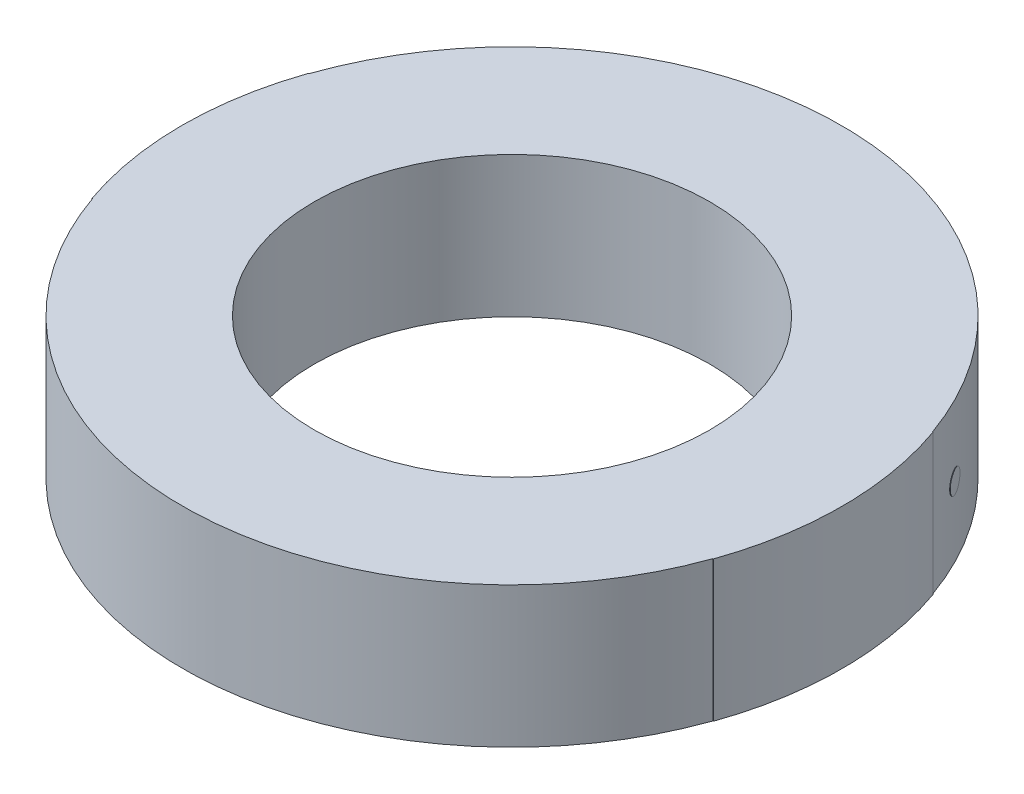
ISO-10303-21;
HEADER;
FILE_DESCRIPTION(('STEP AP214'),'2;1');
FILE_NAME('part.step','',(''),(''),'','','');
FILE_SCHEMA(('AUTOMOTIVE_DESIGN { 1 0 10303 214 1 1 1 1 }'));
ENDSEC;
DATA;
#1=APPLICATION_CONTEXT('core data for automotive mechanical design processes');
#2=APPLICATION_PROTOCOL_DEFINITION('international standard','automotive_design',2000,#1);
#3=PRODUCT_CONTEXT('',#1,'mechanical');
#4=PRODUCT('Part','Part','',(#3));
#5=PRODUCT_RELATED_PRODUCT_CATEGORY('part','',(#4));
#6=PRODUCT_DEFINITION_FORMATION('','',#4);
#7=PRODUCT_DEFINITION_CONTEXT('part definition',#1,'design');
#8=PRODUCT_DEFINITION('design','',#6,#7);
#9=PRODUCT_DEFINITION_SHAPE('','',#8);
#10=(LENGTH_UNIT() NAMED_UNIT(*) SI_UNIT(.MILLI.,.METRE.));
#11=(NAMED_UNIT(*) PLANE_ANGLE_UNIT() SI_UNIT($,.RADIAN.));
#12=(NAMED_UNIT(*) SI_UNIT($,.STERADIAN.) SOLID_ANGLE_UNIT());
#13=UNCERTAINTY_MEASURE_WITH_UNIT(LENGTH_MEASURE(1.E-05),#10,'distance_accuracy_value','');
#14=(GEOMETRIC_REPRESENTATION_CONTEXT(3) GLOBAL_UNCERTAINTY_ASSIGNED_CONTEXT((#13)) GLOBAL_UNIT_ASSIGNED_CONTEXT((#10,
#11,#12)) REPRESENTATION_CONTEXT('',''));
#15=CARTESIAN_POINT('',(0.,0.,0.));
#16=DIRECTION('',(0.,0.,1.));
#17=DIRECTION('',(1.,0.,0.));
#18=AXIS2_PLACEMENT_3D('',#15,#16,#17);
#19=CARTESIAN_POINT('',(0.,3.2,0.));
#20=DIRECTION('',(0.,-1.,0.));
#21=DIRECTION('',(0.,0.,-1.));
#22=AXIS2_PLACEMENT_3D('',#19,#20,#21);
#23=CYLINDRICAL_SURFACE('',#22,7.5);
#24=CARTESIAN_POINT('',(6.57836429172213,1.6,-3.60209983834362));
#25=CARTESIAN_POINT('',(6.5784282600048,1.66659110236433,-3.6019830157442));
#26=CARTESIAN_POINT('',(6.59112962917633,1.72993036889098,-3.57899469577225));
#27=CARTESIAN_POINT('',(6.63530617973489,1.82362302125439,-3.49641312235039));
#28=CARTESIAN_POINT('',(6.66489906424646,1.84998679026845,-3.43998661112045));
#29=CARTESIAN_POINT('',(6.72461643395278,1.85001320768459,-3.3217346729523));
#30=CARTESIAN_POINT('',(6.7524524389661,1.8236041607338,-3.26444185576901));
#31=CARTESIAN_POINT('',(6.79270446738722,1.72994919865098,-3.17983656638727));
#32=CARTESIAN_POINT('',(6.80365777978193,1.66595096937569,-3.15598492280937));
#33=CARTESIAN_POINT('',(6.80376874917029,1.53404898471862,-3.15574568449377));
#34=CARTESIAN_POINT('',(6.79269647668474,1.4700696358423,-3.17985336243044));
#35=CARTESIAN_POINT('',(6.75246040159737,1.3763769403111,-3.26442511872839));
#36=CARTESIAN_POINT('',(6.72461629056032,1.3500132697158,-3.3217349577963));
#37=CARTESIAN_POINT('',(6.66489916626017,1.34998673163119,-3.43998640821438));
#38=CARTESIAN_POINT('',(6.63531504651921,1.37639563779107,-3.49639654762749));
#39=CARTESIAN_POINT('',(6.59112073188739,1.47005103722919,-3.57901132751908));
#40=CARTESIAN_POINT('',(6.57830032343947,1.53340889763566,-3.60221666094305));
#41=CARTESIAN_POINT('',(6.57836429172213,1.6,-3.60209983834362));
#42=B_SPLINE_CURVE_WITH_KNOTS('',3,(#24,#25,#26,#27,#28,#29,#30,#31,#32,#33,#34,#35,#36,#37,#38,
#39,#40,#41),.UNSPECIFIED.,.T.,.F.,(4,2,2,2,2,2,2,2,4),(0.,0.125,0.25,0.375,0.5,0.625,0.75,
0.875,1.),.UNSPECIFIED.);
#43=CARTESIAN_POINT('',(6.57836429172213,1.6,-3.60209983834362));
#44=VERTEX_POINT('',#43);
#45=EDGE_CURVE('E13',#44,#44,#42,.T.);
#46=ORIENTED_EDGE('',*,*,#45,.F.);
#47=EDGE_LOOP('',(#46));
#48=FACE_BOUND('',#47,.T.);
#49=CARTESIAN_POINT('',(0.,0.,0.));
#50=DIRECTION('',(0.,1.,0.));
#51=DIRECTION('',(0.,0.,1.));
#52=AXIS2_PLACEMENT_3D('',#49,#50,#51);
#53=CIRCLE('',#52,7.5);
#54=CARTESIAN_POINT('',(7.07232585554207,0.,-2.49643886226583));
#55=VERTEX_POINT('',#54);
#56=CARTESIAN_POINT('',(-7.08725318392596,0.,-2.45374047261143));
#57=VERTEX_POINT('',#56);
#58=EDGE_CURVE('E322',#55,#57,#53,.T.);
#59=ORIENTED_EDGE('',*,*,#58,.T.);
#60=DIRECTION('',(0.,1.,0.));
#61=VECTOR('',#60,1.);
#62=CARTESIAN_POINT('',(-7.08725318392596,0.,-2.45374047261143));
#63=LINE('',#62,#61);
#64=CARTESIAN_POINT('',(-7.08725318392596,3.2,-2.45374047261143));
#65=VERTEX_POINT('',#64);
#66=EDGE_CURVE('E107',#57,#65,#63,.T.);
#67=ORIENTED_EDGE('',*,*,#66,.T.);
#68=CARTESIAN_POINT('',(0.,3.2,0.));
#69=DIRECTION('',(0.,1.,0.));
#70=DIRECTION('',(0.,0.,1.));
#71=AXIS2_PLACEMENT_3D('',#68,#69,#70);
#72=CIRCLE('',#71,7.5);
#73=CARTESIAN_POINT('',(7.07232585554207,3.2,-2.49643886226583));
#74=VERTEX_POINT('',#73);
#75=EDGE_CURVE('E92',#74,#65,#72,.T.);
#76=ORIENTED_EDGE('',*,*,#75,.F.);
#77=DIRECTION('',(0.,1.,0.));
#78=VECTOR('',#77,1.);
#79=CARTESIAN_POINT('',(7.07232585554207,0.,-2.49643886226583));
#80=LINE('',#79,#78);
#81=EDGE_CURVE('E243',#55,#74,#80,.T.);
#82=ORIENTED_EDGE('',*,*,#81,.F.);
#83=EDGE_LOOP('',(#59,#67,#76,#82));
#84=FACE_BOUND('',#83,.T.);
#85=ADVANCED_FACE('F79',(#48,#84),#23,.T.);
#86=CARTESIAN_POINT('',(-7.08725318392596,3.2,2.45374047261143));
#87=VERTEX_POINT('',#86);
#88=CARTESIAN_POINT('',(7.07232585554207,3.2,2.49643886226584));
#89=VERTEX_POINT('',#88);
#90=EDGE_CURVE('E99',#87,#89,#72,.T.);
#91=ORIENTED_EDGE('',*,*,#90,.F.);
#92=CARTESIAN_POINT('',(-7.08725318392596,3.2,2.45374047261143));
#93=CARTESIAN_POINT('',(-7.08725545267034,3.19333333686698,2.4537339196911));
#94=CARTESIAN_POINT('',(-7.08725772140563,3.18666667373396,2.45372736676762));
#95=CARTESIAN_POINT('',(-7.08726452758424,3.1666666843349,2.45370770798774));
#96=CARTESIAN_POINT('',(-7.0872690650003,3.15333335806887,2.45369460212191));
#97=CARTESIAN_POINT('',(-7.0872826771394,3.11333337927075,2.45365528448664));
#98=CARTESIAN_POINT('',(-7.08729175175339,3.08666672673868,2.45362907267945));
#99=CARTESIAN_POINT('',(-7.08730536345625,3.04666674794056,2.45358975489316));
#100=CARTESIAN_POINT('',(-7.08730990065418,3.03333342167452,2.45357664895181));
#101=CARTESIAN_POINT('',(-7.08731897497734,3.00666676914245,2.45355043704393));
#102=CARTESIAN_POINT('',(-7.08732351210257,2.99333344287641,2.45353733107741));
#103=CARTESIAN_POINT('',(-7.08733258628031,2.96666679034433,2.4535111191192));
#104=CARTESIAN_POINT('',(-7.08733712333283,2.95333346407829,2.45349801312751));
#105=CARTESIAN_POINT('',(-7.08735073438133,2.91333348528018,2.45345869511468));
#106=CARTESIAN_POINT('',(-7.08735980826825,2.8866668327481,2.45343248305579));
#107=CARTESIAN_POINT('',(-7.0873734188805,2.84666685394999,2.45339316489194));
#108=CARTESIAN_POINT('',(-7.0873779557149,2.83333352768395,2.45338005882474));
#109=CARTESIAN_POINT('',(-7.08738702931098,2.80666687515187,2.45335384666518));
#110=CARTESIAN_POINT('',(-7.08739156607267,2.79333354888583,2.45334074057281));
#111=CARTESIAN_POINT('',(-7.08740063952334,2.76666689635376,2.45331452836291));
#112=CARTESIAN_POINT('',(-7.08740517621232,2.75333357008772,2.45330142224537));
#113=CARTESIAN_POINT('',(-7.0874187861702,2.7133335912896,2.45326210385501));
#114=CARTESIAN_POINT('',(-7.08742785933004,2.68666693875753,2.45323589154443));
#115=CARTESIAN_POINT('',(-7.08744146885167,2.64666695995941,2.45319657300307));
#116=CARTESIAN_POINT('',(-7.08744600532253,2.63333363369337,2.45318346681003));
#117=CARTESIAN_POINT('',(-7.08745507819153,2.6066669811613,2.45315725439879));
#118=CARTESIAN_POINT('',(-7.08745961458968,2.59333365489526,2.45314414818059));
#119=CARTESIAN_POINT('',(-7.08746868731327,2.56666700236318,2.45311793571901));
#120=CARTESIAN_POINT('',(-7.08747322363871,2.55333367609714,2.45310482947564));
#121=CARTESIAN_POINT('',(-7.08748683250596,2.51333369729903,2.45306551070778));
#122=CARTESIAN_POINT('',(-7.08749590493871,2.48666704476695,2.45303929814554));
#123=CARTESIAN_POINT('',(-7.08750951336971,2.44666706596884,2.45299997922669));
#124=CARTESIAN_POINT('',(-7.08751404947703,2.4333337397028,2.45298687290783));
#125=CARTESIAN_POINT('',(-7.08752312161894,2.40666708717072,2.45296066024493));
#126=CARTESIAN_POINT('',(-7.08752765765354,2.39333376090469,2.4529475539009));
#127=CARTESIAN_POINT('',(-7.08753672965004,2.36666710837261,2.45292134118767));
#128=CARTESIAN_POINT('',(-7.08754126561194,2.35333378210657,2.45290823481848));
#129=CARTESIAN_POINT('',(-7.08755487338856,2.31333380330846,2.45286891567315));
#130=CARTESIAN_POINT('',(-7.08756394509421,2.28666715077638,2.45284270285927));
#131=CARTESIAN_POINT('',(-7.08757755243457,2.24666717197827,2.45280338356296));
#132=CARTESIAN_POINT('',(-7.08758208817834,2.23333384571223,2.45279027711827));
#133=CARTESIAN_POINT('',(-7.08759115959316,2.20666719318015,2.45276406420374));
#134=CARTESIAN_POINT('',(-7.08759569526422,2.19333386691411,2.45275095773389));
#135=CARTESIAN_POINT('',(-7.08760476653362,2.16666721438204,2.45272474476904));
#136=CARTESIAN_POINT('',(-7.08760930213196,2.153333888116,2.45271163827403));
#137=CARTESIAN_POINT('',(-7.08762290881793,2.11333390931788,2.45267231875126));
#138=CARTESIAN_POINT('',(-7.08763197979649,2.08666725678581,2.45264610568575));
#139=CARTESIAN_POINT('',(-7.0876455860462,2.04666727798769,2.45260678601202));
#140=CARTESIAN_POINT('',(-7.08765012142642,2.03333395172165,2.45259367944152));
#141=CARTESIAN_POINT('',(-7.08765919211413,2.00666729918958,2.45256746627538));
#142=CARTESIAN_POINT('',(-7.08766372742164,1.99333397292354,2.45255435967972));
#143=CARTESIAN_POINT('',(-7.08767279796393,1.96666732039146,2.45252814646326));
#144=CARTESIAN_POINT('',(-7.08767733319872,1.95333399412542,2.45251503984244));
#145=CARTESIAN_POINT('',(-7.08769093879403,1.91333401532731,2.45247571994226));
#146=CARTESIAN_POINT('',(-7.08770000904549,1.88666736279523,2.45244950662516));
#147=CARTESIAN_POINT('',(-7.08771361420454,1.84666738399712,2.45241018657402));
#148=CARTESIAN_POINT('',(-7.0877181492212,1.83333405773108,2.45239707987773));
#149=CARTESIAN_POINT('',(-7.0877272191818,1.806667405199,2.45237086645999));
#150=CARTESIAN_POINT('',(-7.08773175412575,1.79333407893297,2.45235775973854));
#151=CARTESIAN_POINT('',(-7.08774082394094,1.76666742640089,2.45233154627048));
#152=CARTESIAN_POINT('',(-7.08774535881217,1.75333410013485,2.45231843952387));
#153=CARTESIAN_POINT('',(-7.08775896331682,1.71333412133674,2.45227911924631));
#154=CARTESIAN_POINT('',(-7.08776803284116,1.68666746880466,2.45225290567763));
#155=CARTESIAN_POINT('',(-7.08778163690953,1.64666749000655,2.45221358524912));
#156=CARTESIAN_POINT('',(-7.08778617156264,1.63333416374051,2.45220047842704));
#157=CARTESIAN_POINT('',(-7.08779524079613,1.60666751120843,2.45217426475773));
#158=CARTESIAN_POINT('',(-7.08779977537652,1.59333418494239,2.45216115791049));
#159=CARTESIAN_POINT('',(-7.08780884446459,1.56666753241032,2.45213494419087));
#160=CARTESIAN_POINT('',(-7.08781337897226,1.55333420614428,2.45212183731847));
#161=CARTESIAN_POINT('',(-7.08782698238623,1.51333422734616,2.45208251666357));
#162=CARTESIAN_POINT('',(-7.08783605118345,1.48666757481409,2.45205630284331));
#163=CARTESIAN_POINT('',(-7.08784965416114,1.44666759601597,2.45201698203747));
#164=CARTESIAN_POINT('',(-7.08785418845068,1.43333426974993,2.45200387508962));
#165=CARTESIAN_POINT('',(-7.08786325695705,1.40666761721786,2.45197766116875));
#166=CARTESIAN_POINT('',(-7.08786779117387,1.39333429095182,2.45196455419574));
#167=CARTESIAN_POINT('',(-7.08787685953482,1.36666763841974,2.45193834022456));
#168=CARTESIAN_POINT('',(-7.08788139367894,1.35333431215371,2.45192523322639));
#169=CARTESIAN_POINT('',(-7.08789499600222,1.31333433335559,2.45188591219417));
#170=CARTESIAN_POINT('',(-7.0879040640723,1.28666768082351,2.45185969812237));
#171=CARTESIAN_POINT('',(-7.0879176659593,1.2466677020254,2.45182037693923));
#172=CARTESIAN_POINT('',(-7.08792219988528,1.23333437575936,2.4518072698656));
#173=CARTESIAN_POINT('',(-7.08793126766452,1.20666772322729,2.4517810556932));
#174=CARTESIAN_POINT('',(-7.08793580151778,1.19333439696125,2.45176794859442));
#175=CARTESIAN_POINT('',(-7.08794486915159,1.16666774442917,2.45174173437171));
#176=CARTESIAN_POINT('',(-7.08794940293214,1.15333441816313,2.45172862724778));
#177=CARTESIAN_POINT('',(-7.08796300416472,1.11333443936502,2.45168930583827));
#178=CARTESIAN_POINT('',(-7.08797207150767,1.08666778683294,2.45166309151495));
#179=CARTESIAN_POINT('',(-7.08798567230396,1.04666780803483,2.45162376995453));
#180=CARTESIAN_POINT('',(-7.08799020586637,1.03333448176879,2.45161066275514));
#181=CARTESIAN_POINT('',(-7.08799927291847,1.00666782923671,2.45158444833123));
#182=CARTESIAN_POINT('',(-7.08800380640817,0.993334502970674,2.45157134110669));
#183=CARTESIAN_POINT('',(-7.08801287331484,0.966667850438597,2.45154512663248));
#184=CARTESIAN_POINT('',(-7.08801740673182,0.953334524172559,2.45153201938279));
#185=CARTESIAN_POINT('',(-7.08803100687369,0.913334545374444,2.45149269759602));
#186=CARTESIAN_POINT('',(-7.0880400734895,0.886667892842368,2.4514664830212));
#187=CARTESIAN_POINT('',(-7.08805367319508,0.846667914044253,2.45142716108353));
#188=CARTESIAN_POINT('',(-7.08805820639392,0.833334587778215,2.4514140537584));
#189=CARTESIAN_POINT('',(-7.08806727271887,0.806667935246139,2.45138783908299));
#190=CARTESIAN_POINT('',(-7.08807180584499,0.793334608980101,2.45137473173271));
#191=CARTESIAN_POINT('',(-7.08808087202452,0.766667956448024,2.451348517007));
#192=CARTESIAN_POINT('',(-7.08808540507793,0.753334630181986,2.45133540963158));
#193=CARTESIAN_POINT('',(-7.08809900412908,0.713334651383871,2.45129608746757));
#194=CARTESIAN_POINT('',(-7.08810807001774,0.686667998851795,2.45126987264128));
#195=CARTESIAN_POINT('',(-7.08812166863259,0.64666802005368,2.45123055032639));
#196=CARTESIAN_POINT('',(-7.08812620146785,0.633334693787642,2.45121744287552));
#197=CARTESIAN_POINT('',(-7.08813526706566,0.606668041255566,2.45119122794864));
#198=CARTESIAN_POINT('',(-7.08813979982821,0.593334714989528,2.45117812047262));
#199=CARTESIAN_POINT('',(-7.08814886528058,0.566668062457451,2.45115190549545));
#200=CARTESIAN_POINT('',(-7.08815339797041,0.553334736191413,2.45113879799429));
#201=CARTESIAN_POINT('',(-7.08816699593083,0.513334757393298,2.45109947545308));
#202=CARTESIAN_POINT('',(-7.08817606109234,0.486668104861222,2.45107326037533));
#203=CARTESIAN_POINT('',(-7.08818965861646,0.446668126063107,2.45103393768325));
#204=CARTESIAN_POINT('',(-7.08819419108814,0.433334799797069,2.45102083010666));
#205=CARTESIAN_POINT('',(-7.08820325595879,0.406668147264992,2.45099461492832));
#206=CARTESIAN_POINT('',(-7.08820778835775,0.393334820998954,2.45098150732658));
#207=CARTESIAN_POINT('',(-7.08821685308297,0.366668168466878,2.45095529209795));
#208=CARTESIAN_POINT('',(-7.08822138540922,0.353334842200839,2.45094218447107));
#209=CARTESIAN_POINT('',(-7.08823498227889,0.313334863402725,2.4509028615527));
#210=CARTESIAN_POINT('',(-7.08824404671324,0.286668210870648,2.4508766462235));
#211=CARTESIAN_POINT('',(-7.08825764314661,0.246668232072534,2.45083732315427));
#212=CARTESIAN_POINT('',(-7.08826217525471,0.233334905806495,2.45082421545196));
#213=CARTESIAN_POINT('',(-7.08827123939819,0.206668253274419,2.45079800002219));
#214=CARTESIAN_POINT('',(-7.08827577143358,0.193334927008381,2.45078489229473));
#215=CARTESIAN_POINT('',(-7.08828483543162,0.166668274476304,2.45075867681468));
#216=CARTESIAN_POINT('',(-7.08828936739429,0.153334948210266,2.45074556906208));
#217=CARTESIAN_POINT('',(-7.08830183018965,0.116668306814723,2.4507095227136));
#218=CARTESIAN_POINT('',(-7.08830976094736,0.0933349916852175,2.4506865840918));
#219=CARTESIAN_POINT('',(-7.08832562224007,0.0466683614262071,2.45064070677119));
#220=CARTESIAN_POINT('',(-7.08833355277508,0.0233350462967018,2.45061776807239));
#221=CARTESIAN_POINT('',(-7.08834148319874,1.7311671965739E-06,2.4505948293351));
#222=B_SPLINE_CURVE_WITH_KNOTS('',3,(#92,#93,#94,#95,#96,#97,#98,#99,#100,#101,#102,#103,#104,
#105,#106,#107,#108,#109,#110,#111,#112,#113,#114,#115,#116,#117,#118,#119,#120,#121,#122,#123,
#124,#125,#126,#127,#128,#129,#130,#131,#132,#133,#134,#135,#136,#137,#138,#139,#140,#141,#142,
#143,#144,#145,#146,#147,#148,#149,#150,#151,#152,#153,#154,#155,#156,#157,#158,#159,#160,#161,
#162,#163,#164,#165,#166,#167,#168,#169,#170,#171,#172,#173,#174,#175,#176,#177,#178,#179,#180,
#181,#182,#183,#184,#185,#186,#187,#188,#189,#190,#191,#192,#193,#194,#195,#196,#197,#198,#199,
#200,#201,#202,#203,#204,#205,#206,#207,#208,#209,#210,#211,#212,#213,#214,#215,#216,#217,#218,
#219,#220,#221),.UNSPECIFIED.,.F.,.F.,(4,2,2,2,2,2,2,2,2,2,2,2,2,2,2,2,2,2,2,2,2,2,2,2,2,2,2,2,
2,2,2,2,2,2,2,2,2,2,2,2,2,2,2,2,2,2,2,2,2,2,2,2,2,2,2,2,2,2,2,2,2,2,2,2,4),(0.,
0.0200000002188523,0.0600000006565574,0.140000001531967,0.180000001969673,0.220000002407379,
0.260000002845084,0.340000003720493,0.380000004158198,0.420000004595904,0.460000005033609,
0.540000005909018,0.580000006346723,0.620000006784428,0.660000007222133,0.740000008097543,
0.780000008535248,0.820000008972954,0.860000009410658,0.940000010286068,0.980000010723773,
1.02000001116148,1.06000001159918,1.14000001247459,1.1800000129123,1.22000001335,
1.26000001378771,1.34000001466312,1.38000001510082,1.42000001553853,1.46000001597623,
1.54000001685164,1.58000001728935,1.62000001772705,1.66000001816476,1.74000001904017,
1.78000001947787,1.82000001991558,1.86000002035328,1.94000002122869,1.9800000216664,
2.0200000221041,2.06000002254181,2.14000002341722,2.18000002385492,2.22000002429263,
2.26000002473033,2.34000002560574,2.38000002604345,2.42000002648115,2.46000002691886,
2.54000002779427,2.58000002823197,2.62000002866968,2.66000002910738,2.74000002998279,
2.78000003042049,2.8200000308582,2.86000003129591,2.94000003217131,2.98000003260902,
3.02000003304673,3.06000003348443,3.13000001674222,3.20000000000001),.UNSPECIFIED.);
#223=CARTESIAN_POINT('',(-7.08834148319874,1.7311671965739E-06,2.4505948293351));
#224=VERTEX_POINT('',#223);
#225=EDGE_CURVE('E184',#87,#224,#222,.T.);
#226=ORIENTED_EDGE('',*,*,#225,.T.);
#227=CARTESIAN_POINT('',(7.07232585554207,0.,2.49643886226584));
#228=VERTEX_POINT('',#227);
#229=EDGE_CURVE('E316',#224,#228,#53,.T.);
#230=ORIENTED_EDGE('',*,*,#229,.T.);
#231=DIRECTION('',(0.,-1.,0.));
#232=VECTOR('',#231,1.);
#233=CARTESIAN_POINT('',(7.07232585554207,3.2,2.49643886226584));
#234=LINE('',#233,#232);
#235=EDGE_CURVE('E253',#89,#228,#234,.T.);
#236=ORIENTED_EDGE('',*,*,#235,.F.);
#237=EDGE_LOOP('',(#91,#226,#230,#236));
#238=FACE_BOUND('',#237,.T.);
#239=ADVANCED_FACE('F81',(#238),#23,.T.);
#240=CARTESIAN_POINT('',(0.,3.2,0.));
#241=DIRECTION('',(0.,1.,0.));
#242=DIRECTION('',(0.,0.,1.));
#243=AXIS2_PLACEMENT_3D('',#240,#241,#242);
#244=PLANE('',#243);
#245=CARTESIAN_POINT('',(0.,3.2,0.));
#246=DIRECTION('',(0.,1.,0.));
#247=DIRECTION('',(0.,0.,1.));
#248=AXIS2_PLACEMENT_3D('',#245,#246,#247);
#249=CIRCLE('',#248,4.5);
#250=CARTESIAN_POINT('',(0.,3.2,4.5));
#251=VERTEX_POINT('',#250);
#252=EDGE_CURVE('E308',#251,#251,#249,.T.);
#253=ORIENTED_EDGE('',*,*,#252,.F.);
#254=EDGE_LOOP('',(#253));
#255=FACE_BOUND('',#254,.T.);
#256=ORIENTED_EDGE('',*,*,#75,.T.);
#257=DIRECTION('',(-0.944967091190128,0.,-0.32716539634819));
#258=VECTOR('',#257,1.);
#259=CARTESIAN_POINT('',(-7.08725318392596,3.2,-2.45374047261143));
#260=LINE('',#259,#258);
#261=CARTESIAN_POINT('',(-7.09670285483786,3.2,-2.45701212657491));
#262=VERTEX_POINT('',#261);
#263=EDGE_CURVE('E157',#65,#262,#260,.T.);
#264=ORIENTED_EDGE('',*,*,#263,.T.);
#265=CARTESIAN_POINT('',(0.,3.2,0.));
#266=DIRECTION('',(0.,-1.,0.));
#267=DIRECTION('',(0.,0.,-1.));
#268=AXIS2_PLACEMENT_3D('',#265,#266,#267);
#269=CIRCLE('',#268,7.51);
#270=CARTESIAN_POINT('',(-7.09670285483786,3.2,2.45701212657491));
#271=VERTEX_POINT('',#270);
#272=EDGE_CURVE('E174',#262,#271,#269,.F.);
#273=ORIENTED_EDGE('',*,*,#272,.T.);
#274=CARTESIAN_POINT('',(-7.08725318392596,3.2,2.45374047261143));
#275=CARTESIAN_POINT('',(-7.09670285483786,3.2,2.45701212657491));
#276=B_SPLINE_CURVE_WITH_KNOTS('',1,(#274,#275),.UNSPECIFIED.,.F.,.F.,(2,2),(0.,1.),.UNSPECIFIED.);
#277=EDGE_CURVE('E256',#87,#271,#276,.T.);
#278=ORIENTED_EDGE('',*,*,#277,.F.);
#279=ORIENTED_EDGE('',*,*,#90,.T.);
#280=DIRECTION('',(0.942976780738942,0.,0.332858514968778));
#281=VECTOR('',#280,1.);
#282=CARTESIAN_POINT('',(7.07232585554207,3.2,2.49643886226584));
#283=LINE('',#282,#281);
#284=CARTESIAN_POINT('',(7.08175562334946,3.2,2.49976744741553));
#285=VERTEX_POINT('',#284);
#286=EDGE_CURVE('E247',#89,#285,#283,.T.);
#287=ORIENTED_EDGE('',*,*,#286,.T.);
#288=CARTESIAN_POINT('',(0.,3.2,0.));
#289=DIRECTION('',(0.,-1.,0.));
#290=DIRECTION('',(0.,0.,-1.));
#291=AXIS2_PLACEMENT_3D('',#288,#289,#290);
#292=CIRCLE('',#291,7.51);
#293=CARTESIAN_POINT('',(7.08175562334946,3.2,-2.49976744741552));
#294=VERTEX_POINT('',#293);
#295=EDGE_CURVE('E234',#285,#294,#292,.F.);
#296=ORIENTED_EDGE('',*,*,#295,.T.);
#297=DIRECTION('',(0.942976780738943,0.,-0.332858514968777));
#298=VECTOR('',#297,1.);
#299=CARTESIAN_POINT('',(7.07232585554207,3.2,-2.49643886226583));
#300=LINE('',#299,#298);
#301=EDGE_CURVE('E259',#74,#294,#300,.T.);
#302=ORIENTED_EDGE('',*,*,#301,.F.);
#303=EDGE_LOOP('',(#256,#264,#273,#278,#279,#287,#296,#302));
#304=FACE_BOUND('',#303,.T.);
#305=ADVANCED_FACE('F345',(#255,#304),#244,.T.);
#306=CARTESIAN_POINT('',(0.,0.,0.));
#307=DIRECTION('',(0.,1.,0.));
#308=DIRECTION('',(0.,0.,1.));
#309=AXIS2_PLACEMENT_3D('',#306,#307,#308);
#310=PLANE('',#309);
#311=CARTESIAN_POINT('',(0.,0.,0.));
#312=DIRECTION('',(0.,1.,0.));
#313=DIRECTION('',(0.,0.,1.));
#314=AXIS2_PLACEMENT_3D('',#311,#312,#313);
#315=CIRCLE('',#314,4.5);
#316=CARTESIAN_POINT('',(0.,0.,4.5));
#317=VERTEX_POINT('',#316);
#318=EDGE_CURVE('E317',#317,#317,#315,.T.);
#319=ORIENTED_EDGE('',*,*,#318,.T.);
#320=EDGE_LOOP('',(#319));
#321=FACE_BOUND('',#320,.T.);
#322=ORIENTED_EDGE('',*,*,#58,.F.);
#323=DIRECTION('',(0.942976780738943,0.,-0.332858514968777));
#324=VECTOR('',#323,1.);
#325=CARTESIAN_POINT('',(7.07232585554207,0.,-2.49643886226583));
#326=LINE('',#325,#324);
#327=CARTESIAN_POINT('',(7.08175562334946,0.,-2.49976744741552));
#328=VERTEX_POINT('',#327);
#329=EDGE_CURVE('E261',#55,#328,#326,.T.);
#330=ORIENTED_EDGE('',*,*,#329,.T.);
#331=CARTESIAN_POINT('',(0.,0.,0.));
#332=DIRECTION('',(0.,-1.,0.));
#333=DIRECTION('',(0.,0.,-1.));
#334=AXIS2_PLACEMENT_3D('',#331,#332,#333);
#335=CIRCLE('',#334,7.51);
#336=CARTESIAN_POINT('',(7.08175562334946,0.,2.49976744741553));
#337=VERTEX_POINT('',#336);
#338=EDGE_CURVE('E248',#337,#328,#335,.F.);
#339=ORIENTED_EDGE('',*,*,#338,.F.);
#340=DIRECTION('',(0.942976780738942,0.,0.332858514968778));
#341=VECTOR('',#340,1.);
#342=CARTESIAN_POINT('',(7.07232585554207,0.,2.49643886226584));
#343=LINE('',#342,#341);
#344=EDGE_CURVE('E263',#228,#337,#343,.T.);
#345=ORIENTED_EDGE('',*,*,#344,.F.);
#346=ORIENTED_EDGE('',*,*,#229,.F.);
#347=CARTESIAN_POINT('',(-7.09779260517634,1.7311671965739E-06,2.45386228910754));
#348=CARTESIAN_POINT('',(-7.08834148319874,1.7311671965739E-06,2.4505948293351));
#349=B_SPLINE_CURVE_WITH_KNOTS('',1,(#347,#348),.UNSPECIFIED.,.F.,.F.,(2,2),(0.,1.),.UNSPECIFIED.);
#350=CARTESIAN_POINT('',(-7.09779260517634,1.7311671965739E-06,2.45386228910754));
#351=VERTEX_POINT('',#350);
#352=EDGE_CURVE('E158',#224,#351,#349,.F.);
#353=ORIENTED_EDGE('',*,*,#352,.T.);
#354=CARTESIAN_POINT('',(0.,0.,0.));
#355=DIRECTION('',(0.,-1.,0.));
#356=DIRECTION('',(0.,0.,-1.));
#357=AXIS2_PLACEMENT_3D('',#354,#355,#356);
#358=CIRCLE('',#357,7.51);
#359=CARTESIAN_POINT('',(-7.09670285483786,0.,-2.45701212657491));
#360=VERTEX_POINT('',#359);
#361=EDGE_CURVE('E161',#360,#351,#358,.F.);
#362=ORIENTED_EDGE('',*,*,#361,.F.);
#363=DIRECTION('',(-0.944967091190128,0.,-0.32716539634819));
#364=VECTOR('',#363,1.);
#365=CARTESIAN_POINT('',(-7.08725318392596,0.,-2.45374047261143));
#366=LINE('',#365,#364);
#367=EDGE_CURVE('E150',#57,#360,#366,.T.);
#368=ORIENTED_EDGE('',*,*,#367,.F.);
#369=EDGE_LOOP('',(#322,#330,#339,#345,#346,#353,#362,#368));
#370=FACE_BOUND('',#369,.T.);
#371=ADVANCED_FACE('F162',(#321,#370),#310,.F.);
#372=CARTESIAN_POINT('',(0.,3.2,0.));
#373=DIRECTION('',(0.,-1.,0.));
#374=DIRECTION('',(0.,0.,-1.));
#375=AXIS2_PLACEMENT_3D('',#372,#373,#374);
#376=CYLINDRICAL_SURFACE('',#375,4.5);
#377=ORIENTED_EDGE('',*,*,#252,.T.);
#378=EDGE_LOOP('',(#377));
#379=FACE_BOUND('',#378,.T.);
#380=ORIENTED_EDGE('',*,*,#318,.F.);
#381=EDGE_LOOP('',(#380));
#382=FACE_BOUND('',#381,.T.);
#383=ADVANCED_FACE('F292',(#379,#382),#376,.F.);
#384=CARTESIAN_POINT('',(6.5871354441111,1.6,-3.60690263812808));
#385=CARTESIAN_POINT('',(6.58719949768481,1.66659110236433,-3.60678565976519));
#386=CARTESIAN_POINT('',(6.59991780201523,1.72993036889098,-3.58376668869994));
#387=CARTESIAN_POINT('',(6.6441532546412,1.82362302125439,-3.50107500651353));
#388=CARTESIAN_POINT('',(6.67378559633212,1.84998679026845,-3.44457325993528));
#389=CARTESIAN_POINT('',(6.73358258919805,1.85001320768459,-3.32616365251623));
#390=CARTESIAN_POINT('',(6.76145570888472,1.8236041607338,-3.26879444491003));
#391=CARTESIAN_POINT('',(6.80176140667706,1.72994919865098,-3.18407634847579));
#392=CARTESIAN_POINT('',(6.81272932348831,1.66595096937569,-3.16019290270645));
#393=CARTESIAN_POINT('',(6.81284044083585,1.53404898471862,-3.15995334540643));
#394=CARTESIAN_POINT('',(6.80175340532032,1.4700696358423,-3.18409316691369));
#395=CARTESIAN_POINT('',(6.76146368213284,1.3763769403111,-3.26877768555336));
#396=CARTESIAN_POINT('',(6.7335824456144,1.3500132697158,-3.32616393774003));
#397=CARTESIAN_POINT('',(6.67378569848185,1.34998673163119,-3.44457305675866));
#398=CARTESIAN_POINT('',(6.6441621332479,1.37639563779107,-3.50105840969099));
#399=CARTESIAN_POINT('',(6.59990889286324,1.47005103722919,-3.58378334262244));
#400=CARTESIAN_POINT('',(6.58707139053739,1.53340889763566,-3.60701961649097));
#401=CARTESIAN_POINT('',(6.5871354441111,1.6,-3.60690263812808));
#402=CARTESIAN_POINT('',(6.57836429172213,1.6,-3.60209983834362));
#403=CARTESIAN_POINT('',(6.5784282600048,1.66659110236433,-3.6019830157442));
#404=CARTESIAN_POINT('',(6.59112962917633,1.72993036889098,-3.57899469577225));
#405=CARTESIAN_POINT('',(6.63530617973489,1.82362302125439,-3.49641312235039));
#406=CARTESIAN_POINT('',(6.66489906424646,1.84998679026845,-3.43998661112045));
#407=CARTESIAN_POINT('',(6.72461643395278,1.85001320768459,-3.3217346729523));
#408=CARTESIAN_POINT('',(6.7524524389661,1.8236041607338,-3.26444185576901));
#409=CARTESIAN_POINT('',(6.79270446738722,1.72994919865098,-3.17983656638727));
#410=CARTESIAN_POINT('',(6.80365777978193,1.66595096937569,-3.15598492280937));
#411=CARTESIAN_POINT('',(6.80376874917029,1.53404898471862,-3.15574568449377));
#412=CARTESIAN_POINT('',(6.79269647668474,1.4700696358423,-3.17985336243044));
#413=CARTESIAN_POINT('',(6.75246040159737,1.3763769403111,-3.26442511872839));
#414=CARTESIAN_POINT('',(6.72461629056032,1.3500132697158,-3.3217349577963));
#415=CARTESIAN_POINT('',(6.66489916626017,1.34998673163119,-3.43998640821438));
#416=CARTESIAN_POINT('',(6.63531504651921,1.37639563779107,-3.49639654762749));
#417=CARTESIAN_POINT('',(6.59112073188739,1.47005103722919,-3.57901132751908));
#418=CARTESIAN_POINT('',(6.57830032343947,1.53340889763566,-3.60221666094305));
#419=CARTESIAN_POINT('',(6.57836429172213,1.6,-3.60209983834362));
#420=B_SPLINE_SURFACE_WITH_KNOTS('',1,3,((#384,#385,#386,#387,#388,#389,#390,#391,#392,#393,
#394,#395,#396,#397,#398,#399,#400,#401),(#402,#403,#404,#405,#406,#407,#408,#409,#410,#411,
#412,#413,#414,#415,#416,#417,#418,#419)),.UNSPECIFIED.,.F.,.T.,.F.,(2,2),(4,2,2,2,2,2,2,2,4),
(0.,1.),(0.,0.125,0.25,0.375,0.5,0.625,0.75,0.875,1.),.UNSPECIFIED.);
#421=CARTESIAN_POINT('',(6.5871354441111,1.6,-3.60690263812808));
#422=CARTESIAN_POINT('',(6.58707139053739,1.53340889763566,-3.60701961649097));
#423=CARTESIAN_POINT('',(6.59990889286324,1.47005103722919,-3.58378334262244));
#424=CARTESIAN_POINT('',(6.6441621332479,1.37639563779107,-3.50105840969099));
#425=CARTESIAN_POINT('',(6.67378569848185,1.34998673163119,-3.44457305675866));
#426=CARTESIAN_POINT('',(6.7335824456144,1.3500132697158,-3.32616393774003));
#427=CARTESIAN_POINT('',(6.76146368213284,1.3763769403111,-3.26877768555336));
#428=CARTESIAN_POINT('',(6.80175340532032,1.4700696358423,-3.18409316691369));
#429=CARTESIAN_POINT('',(6.81284044083585,1.53404898471862,-3.15995334540643));
#430=CARTESIAN_POINT('',(6.81272932348831,1.66595096937569,-3.16019290270645));
#431=CARTESIAN_POINT('',(6.80176140667706,1.72994919865098,-3.18407634847579));
#432=CARTESIAN_POINT('',(6.76145570888472,1.8236041607338,-3.26879444491003));
#433=CARTESIAN_POINT('',(6.73358258919805,1.85001320768459,-3.32616365251623));
#434=CARTESIAN_POINT('',(6.67378559633212,1.84998679026845,-3.44457325993528));
#435=CARTESIAN_POINT('',(6.6441532546412,1.82362302125439,-3.50107500651353));
#436=CARTESIAN_POINT('',(6.59991780201523,1.72993036889098,-3.58376668869994));
#437=CARTESIAN_POINT('',(6.58719949768481,1.66659110236433,-3.60678565976519));
#438=CARTESIAN_POINT('',(6.5871354441111,1.6,-3.60690263812808));
#439=B_SPLINE_CURVE_WITH_KNOTS('',3,(#421,#422,#423,#424,#425,#426,#427,#428,#429,#430,#431,
#432,#433,#434,#435,#436,#437,#438),.UNSPECIFIED.,.T.,.F.,(4,2,2,2,2,2,2,2,4),(0.,0.125,0.25,
0.375,0.5,0.625,0.75,0.875,1.),.UNSPECIFIED.);
#440=CARTESIAN_POINT('',(6.5871354441111,1.6,-3.60690263812808));
#441=VERTEX_POINT('',#440);
#442=EDGE_CURVE('E265',#441,#441,#439,.F.);
#443=ORIENTED_EDGE('',*,*,#442,.F.);
#444=EDGE_LOOP('',(#443));
#445=FACE_BOUND('',#444,.T.);
#446=ORIENTED_EDGE('',*,*,#45,.T.);
#447=EDGE_LOOP('',(#446));
#448=FACE_BOUND('',#447,.T.);
#449=ADVANCED_FACE('F284',(#445,#448),#420,.T.);
#450=CARTESIAN_POINT('',(0.,3.2,0.));
#451=DIRECTION('',(0.,-1.,0.));
#452=DIRECTION('',(0.,0.,-1.));
#453=AXIS2_PLACEMENT_3D('',#450,#451,#452);
#454=CYLINDRICAL_SURFACE('',#453,7.51);
#455=ORIENTED_EDGE('',*,*,#442,.T.);
#456=EDGE_LOOP('',(#455));
#457=FACE_BOUND('',#456,.T.);
#458=ADVANCED_FACE('F273',(#457),#454,.T.);
#459=CARTESIAN_POINT('',(7.07232585554207,1.6,-2.49643886226583));
#460=DIRECTION('',(-0.332858514968777,0.,-0.942976780738943));
#461=DIRECTION('',(0.,1.,0.));
#462=AXIS2_PLACEMENT_3D('',#459,#460,#461);
#463=PLANE('',#462);
#464=ORIENTED_EDGE('',*,*,#329,.F.);
#465=ORIENTED_EDGE('',*,*,#81,.T.);
#466=ORIENTED_EDGE('',*,*,#301,.T.);
#467=DIRECTION('',(0.,-1.,0.));
#468=VECTOR('',#467,1.);
#469=CARTESIAN_POINT('',(7.08175562334946,3.2,-2.49976744741552));
#470=LINE('',#469,#468);
#471=EDGE_CURVE('E244',#328,#294,#470,.F.);
#472=ORIENTED_EDGE('',*,*,#471,.F.);
#473=EDGE_LOOP('',(#464,#465,#466,#472));
#474=FACE_BOUND('',#473,.T.);
#475=ADVANCED_FACE('F283',(#474),#463,.T.);
#476=CARTESIAN_POINT('',(7.07232585554207,1.6,2.49643886226584));
#477=DIRECTION('',(-0.332858514968778,0.,0.942976780738942));
#478=DIRECTION('',(0.,-1.,0.));
#479=AXIS2_PLACEMENT_3D('',#476,#477,#478);
#480=PLANE('',#479);
#481=ORIENTED_EDGE('',*,*,#235,.T.);
#482=ORIENTED_EDGE('',*,*,#344,.T.);
#483=DIRECTION('',(0.,-1.,0.));
#484=VECTOR('',#483,1.);
#485=CARTESIAN_POINT('',(7.08175562334946,3.2,2.49976744741553));
#486=LINE('',#485,#484);
#487=EDGE_CURVE('E242',#285,#337,#486,.T.);
#488=ORIENTED_EDGE('',*,*,#487,.F.);
#489=ORIENTED_EDGE('',*,*,#286,.F.);
#490=EDGE_LOOP('',(#481,#482,#488,#489));
#491=FACE_BOUND('',#490,.T.);
#492=ADVANCED_FACE('F286',(#491),#480,.T.);
#493=CARTESIAN_POINT('',(0.,3.2,0.));
#494=DIRECTION('',(0.,-1.,0.));
#495=DIRECTION('',(0.,0.,-1.));
#496=AXIS2_PLACEMENT_3D('',#493,#494,#495);
#497=CYLINDRICAL_SURFACE('',#496,7.51);
#498=ORIENTED_EDGE('',*,*,#295,.F.);
#499=ORIENTED_EDGE('',*,*,#487,.T.);
#500=ORIENTED_EDGE('',*,*,#338,.T.);
#501=ORIENTED_EDGE('',*,*,#471,.T.);
#502=EDGE_LOOP('',(#498,#499,#500,#501));
#503=FACE_BOUND('',#502,.T.);
#504=ADVANCED_FACE('F204',(#503),#497,.T.);
#505=CARTESIAN_POINT('',(-7.08725318392596,1.6,-2.45374047261143));
#506=DIRECTION('',(-0.32716539634819,0.,0.944967091190128));
#507=DIRECTION('',(0.,1.,0.));
#508=AXIS2_PLACEMENT_3D('',#505,#506,#507);
#509=PLANE('',#508);
#510=ORIENTED_EDGE('',*,*,#263,.F.);
#511=ORIENTED_EDGE('',*,*,#66,.F.);
#512=ORIENTED_EDGE('',*,*,#367,.T.);
#513=DIRECTION('',(0.,-1.,0.));
#514=VECTOR('',#513,1.);
#515=CARTESIAN_POINT('',(-7.09670285483786,3.2,-2.45701212657491));
#516=LINE('',#515,#514);
#517=EDGE_CURVE('E155',#360,#262,#516,.F.);
#518=ORIENTED_EDGE('',*,*,#517,.T.);
#519=EDGE_LOOP('',(#510,#511,#512,#518));
#520=FACE_BOUND('',#519,.T.);
#521=ADVANCED_FACE('F153',(#520),#509,.F.);
#522=CARTESIAN_POINT('',(-7.09670285483786,3.2,2.45701212657491));
#523=CARTESIAN_POINT('',(-7.09706633793353,2.13333391038906,2.45596226137691));
#524=CARTESIAN_POINT('',(-7.09742958805828,1.06666782077813,2.45491231551998));
#525=CARTESIAN_POINT('',(-7.09779260517634,1.7311671965739E-06,2.45386228910754));
#526=CARTESIAN_POINT('',(-7.08725318392596,3.2,2.45374047261143));
#527=CARTESIAN_POINT('',(-7.08761618302284,2.13333391038906,2.45269200536975));
#528=CARTESIAN_POINT('',(-7.08797894945901,1.06666782077813,2.45164345757655));
#529=CARTESIAN_POINT('',(-7.08834148319874,1.7311671965739E-06,2.4505948293351));
#530=B_SPLINE_SURFACE_WITH_KNOTS('',1,3,((#522,#523,#524,#525),(#526,#527,#528,#529)),
.UNSPECIFIED.,.F.,.F.,.F.,(2,2),(4,4),(0.,1.),(0.,1.),.UNSPECIFIED.);
#531=CARTESIAN_POINT('',(-7.09670285483786,3.2,2.45701212657491));
#532=CARTESIAN_POINT('',(-7.09706633793353,2.13333391038906,2.45596226137691));
#533=CARTESIAN_POINT('',(-7.09742958805828,1.06666782077813,2.45491231551998));
#534=CARTESIAN_POINT('',(-7.09779260517634,1.7311671965739E-06,2.45386228910754));
#535=B_SPLINE_CURVE_WITH_KNOTS('',3,(#531,#532,#533,#534),.UNSPECIFIED.,.F.,.F.,(4,4),(0.,1.),.UNSPECIFIED.);
#536=EDGE_CURVE('E169',#271,#351,#535,.T.);
#537=ORIENTED_EDGE('',*,*,#225,.F.);
#538=ORIENTED_EDGE('',*,*,#277,.T.);
#539=ORIENTED_EDGE('',*,*,#536,.T.);
#540=ORIENTED_EDGE('',*,*,#352,.F.);
#541=EDGE_LOOP('',(#537,#538,#539,#540));
#542=FACE_BOUND('',#541,.T.);
#543=ADVANCED_FACE('F201',(#542),#530,.F.);
#544=CARTESIAN_POINT('',(0.,3.2,0.));
#545=DIRECTION('',(0.,-1.,0.));
#546=DIRECTION('',(0.,0.,-1.));
#547=AXIS2_PLACEMENT_3D('',#544,#545,#546);
#548=CYLINDRICAL_SURFACE('',#547,7.51);
#549=ORIENTED_EDGE('',*,*,#361,.T.);
#550=ORIENTED_EDGE('',*,*,#536,.F.);
#551=ORIENTED_EDGE('',*,*,#272,.F.);
#552=ORIENTED_EDGE('',*,*,#517,.F.);
#553=EDGE_LOOP('',(#549,#550,#551,#552));
#554=FACE_BOUND('',#553,.T.);
#555=ADVANCED_FACE('F172',(#554),#548,.T.);
#556=CLOSED_SHELL('',(#85,#239,#305,#371,#383,#449,#458,#475,#492,#504,#521,#543,#555));
#557=MANIFOLD_SOLID_BREP('B2',#556);
#558=ADVANCED_BREP_SHAPE_REPRESENTATION('',(#18,#557),#14);
#559=SHAPE_DEFINITION_REPRESENTATION(#9,#558);
ENDSEC;
END-ISO-10303-21;
